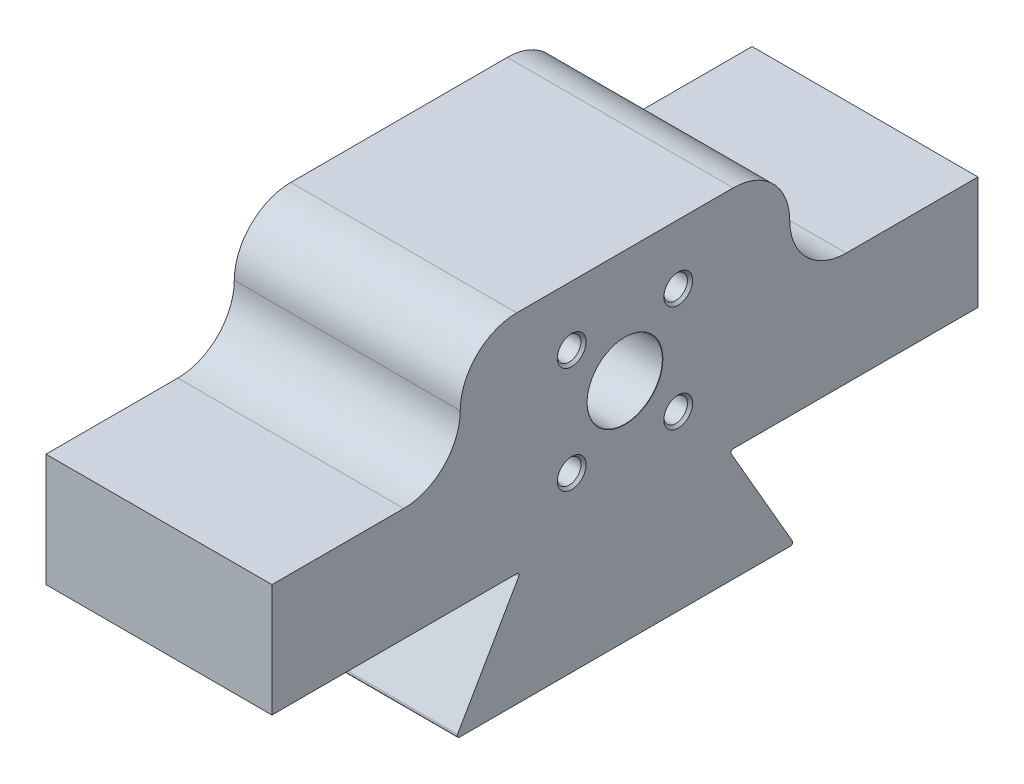
ISO-10303-21;
HEADER;
FILE_DESCRIPTION(('STEP AP214'),'2;1');
FILE_NAME('part.step','',(''),(''),'','','');
FILE_SCHEMA(('AUTOMOTIVE_DESIGN { 1 0 10303 214 1 1 1 1 }'));
ENDSEC;
DATA;
#1=APPLICATION_CONTEXT('core data for automotive mechanical design processes');
#2=APPLICATION_PROTOCOL_DEFINITION('international standard','automotive_design',2000,#1);
#3=PRODUCT_CONTEXT('',#1,'mechanical');
#4=PRODUCT('Part','Part','',(#3));
#5=PRODUCT_RELATED_PRODUCT_CATEGORY('part','',(#4));
#6=PRODUCT_DEFINITION_FORMATION('','',#4);
#7=PRODUCT_DEFINITION_CONTEXT('part definition',#1,'design');
#8=PRODUCT_DEFINITION('design','',#6,#7);
#9=PRODUCT_DEFINITION_SHAPE('','',#8);
#10=(LENGTH_UNIT() NAMED_UNIT(*) SI_UNIT(.MILLI.,.METRE.));
#11=(NAMED_UNIT(*) PLANE_ANGLE_UNIT() SI_UNIT($,.RADIAN.));
#12=(NAMED_UNIT(*) SI_UNIT($,.STERADIAN.) SOLID_ANGLE_UNIT());
#13=UNCERTAINTY_MEASURE_WITH_UNIT(LENGTH_MEASURE(1.E-05),#10,'distance_accuracy_value','');
#14=(GEOMETRIC_REPRESENTATION_CONTEXT(3) GLOBAL_UNCERTAINTY_ASSIGNED_CONTEXT((#13)) GLOBAL_UNIT_ASSIGNED_CONTEXT((#10,
#11,#12)) REPRESENTATION_CONTEXT('',''));
#15=CARTESIAN_POINT('',(0.,0.,0.));
#16=DIRECTION('',(0.,0.,1.));
#17=DIRECTION('',(1.,0.,0.));
#18=AXIS2_PLACEMENT_3D('',#15,#16,#17);
#19=CARTESIAN_POINT('',(24.,-12.0000000000001,-37.4999999999996));
#20=DIRECTION('',(0.,1.,0.));
#21=DIRECTION('',(0.,0.,1.));
#22=AXIS2_PLACEMENT_3D('',#19,#20,#21);
#23=PLANE('',#22);
#24=DIRECTION('',(0.,0.,-1.));
#25=VECTOR('',#24,1.);
#26=CARTESIAN_POINT('',(24.,-12.0000000000001,-37.4999999999996));
#27=LINE('',#26,#25);
#28=CARTESIAN_POINT('',(24.,-12.0000000000001,-11.5048094716166));
#29=VERTEX_POINT('',#28);
#30=CARTESIAN_POINT('',(24.,-12.0000000000001,-37.4999999999996));
#31=VERTEX_POINT('',#30);
#32=EDGE_CURVE('E251',#29,#31,#27,.T.);
#33=ORIENTED_EDGE('',*,*,#32,.F.);
#34=DIRECTION('',(1.,0.,0.));
#35=VECTOR('',#34,1.);
#36=CARTESIAN_POINT('',(24.,-12.0000000000001,-11.5048094716166));
#37=LINE('',#36,#35);
#38=CARTESIAN_POINT('',(0.,-12.0000000000001,-11.5048094716166));
#39=VERTEX_POINT('',#38);
#40=EDGE_CURVE('E323',#29,#39,#37,.F.);
#41=ORIENTED_EDGE('',*,*,#40,.T.);
#42=DIRECTION('',(0.,0.,-1.));
#43=VECTOR('',#42,1.);
#44=CARTESIAN_POINT('',(0.,-12.0000000000001,-37.4999999999996));
#45=LINE('',#44,#43);
#46=CARTESIAN_POINT('',(0.,-12.0000000000001,-37.4999999999996));
#47=VERTEX_POINT('',#46);
#48=EDGE_CURVE('E263',#39,#47,#45,.T.);
#49=ORIENTED_EDGE('',*,*,#48,.T.);
#50=DIRECTION('',(-1.,0.,0.));
#51=VECTOR('',#50,1.);
#52=CARTESIAN_POINT('',(24.,-12.0000000000001,-37.4999999999996));
#53=LINE('',#52,#51);
#54=EDGE_CURVE('E261',#31,#47,#53,.T.);
#55=ORIENTED_EDGE('',*,*,#54,.F.);
#56=EDGE_LOOP('',(#33,#41,#49,#55));
#57=FACE_BOUND('',#56,.T.);
#58=ADVANCED_FACE('F38',(#57),#23,.F.);
#59=CARTESIAN_POINT('',(24.,11.9999999999999,-37.4999999999996));
#60=DIRECTION('',(0.,0.,1.));
#61=DIRECTION('',(1.,0.,0.));
#62=AXIS2_PLACEMENT_3D('',#59,#60,#61);
#63=PLANE('',#62);
#64=DIRECTION('',(1.,0.,0.));
#65=VECTOR('',#64,1.);
#66=CARTESIAN_POINT('',(0.,-1.40512601554121E-13,-37.5000000000001));
#67=LINE('',#66,#65);
#68=CARTESIAN_POINT('',(0.,-1.40512601554121E-13,-37.5000000000001));
#69=VERTEX_POINT('',#68);
#70=CARTESIAN_POINT('',(24.,-1.40512601554121E-13,-37.5000000000001));
#71=VERTEX_POINT('',#70);
#72=EDGE_CURVE('E233',#69,#71,#67,.T.);
#73=ORIENTED_EDGE('',*,*,#72,.T.);
#74=DIRECTION('',(0.,1.,0.));
#75=VECTOR('',#74,1.);
#76=CARTESIAN_POINT('',(24.,11.9999999999999,-37.4999999999996));
#77=LINE('',#76,#75);
#78=EDGE_CURVE('E256',#31,#71,#77,.T.);
#79=ORIENTED_EDGE('',*,*,#78,.F.);
#80=ORIENTED_EDGE('',*,*,#54,.T.);
#81=DIRECTION('',(0.,1.,0.));
#82=VECTOR('',#81,1.);
#83=CARTESIAN_POINT('',(0.,11.9999999999999,-37.4999999999996));
#84=LINE('',#83,#82);
#85=EDGE_CURVE('E266',#47,#69,#84,.T.);
#86=ORIENTED_EDGE('',*,*,#85,.T.);
#87=EDGE_LOOP('',(#73,#79,#80,#86));
#88=FACE_BOUND('',#87,.T.);
#89=ADVANCED_FACE('F396',(#88),#63,.F.);
#90=CARTESIAN_POINT('',(24.,11.9999999999999,-37.4999999999996));
#91=DIRECTION('',(0.,-1.,0.));
#92=DIRECTION('',(0.,0.,-1.));
#93=AXIS2_PLACEMENT_3D('',#90,#91,#92);
#94=PLANE('',#93);
#95=DIRECTION('',(0.,0.,1.));
#96=VECTOR('',#95,1.);
#97=CARTESIAN_POINT('',(24.,11.9999999999999,-37.4999999999996));
#98=LINE('',#97,#96);
#99=CARTESIAN_POINT('',(24.,11.9999999999999,-11.5000000000001));
#100=VERTEX_POINT('',#99);
#101=CARTESIAN_POINT('',(24.,11.9999999999999,11.5000000000001));
#102=VERTEX_POINT('',#101);
#103=EDGE_CURVE('E259',#100,#102,#98,.T.);
#104=ORIENTED_EDGE('',*,*,#103,.F.);
#105=DIRECTION('',(1.,0.,0.));
#106=VECTOR('',#105,1.);
#107=CARTESIAN_POINT('',(0.,11.9999999999999,-11.5000000000001));
#108=LINE('',#107,#106);
#109=CARTESIAN_POINT('',(0.,11.9999999999999,-11.5000000000001));
#110=VERTEX_POINT('',#109);
#111=EDGE_CURVE('E293',#100,#110,#108,.F.);
#112=ORIENTED_EDGE('',*,*,#111,.T.);
#113=DIRECTION('',(0.,0.,1.));
#114=VECTOR('',#113,1.);
#115=CARTESIAN_POINT('',(0.,11.9999999999999,-37.4999999999996));
#116=LINE('',#115,#114);
#117=CARTESIAN_POINT('',(0.,11.9999999999999,11.5000000000001));
#118=VERTEX_POINT('',#117);
#119=EDGE_CURVE('E252',#110,#118,#116,.T.);
#120=ORIENTED_EDGE('',*,*,#119,.T.);
#121=DIRECTION('',(1.,0.,0.));
#122=VECTOR('',#121,1.);
#123=CARTESIAN_POINT('',(24.,11.9999999999999,11.5000000000001));
#124=LINE('',#123,#122);
#125=EDGE_CURVE('E275',#118,#102,#124,.T.);
#126=ORIENTED_EDGE('',*,*,#125,.T.);
#127=EDGE_LOOP('',(#104,#112,#120,#126));
#128=FACE_BOUND('',#127,.T.);
#129=ADVANCED_FACE('F380',(#128),#94,.F.);
#130=CARTESIAN_POINT('',(24.,0.,0.));
#131=DIRECTION('',(-1.,0.,0.));
#132=DIRECTION('',(0.,0.,1.));
#133=AXIS2_PLACEMENT_3D('',#130,#131,#132);
#134=PLANE('',#133);
#135=CARTESIAN_POINT('',(24.,5.65685424949238,5.65685424949238));
#136=DIRECTION('',(1.,0.,0.));
#137=DIRECTION('',(0.,0.,-1.));
#138=AXIS2_PLACEMENT_3D('',#135,#136,#137);
#139=CIRCLE('',#138,1.525);
#140=CARTESIAN_POINT('',(24.,5.65685424949238,4.13185424949238));
#141=VERTEX_POINT('',#140);
#142=EDGE_CURVE('E193',#141,#141,#139,.T.);
#143=ORIENTED_EDGE('',*,*,#142,.F.);
#144=EDGE_LOOP('',(#143));
#145=FACE_BOUND('',#144,.T.);
#146=CARTESIAN_POINT('',(24.,5.65685424949238,-5.65685424949238));
#147=DIRECTION('',(1.,0.,0.));
#148=DIRECTION('',(0.,0.,-1.));
#149=AXIS2_PLACEMENT_3D('',#146,#147,#148);
#150=CIRCLE('',#149,1.525);
#151=CARTESIAN_POINT('',(24.,5.65685424949238,-7.18185424949238));
#152=VERTEX_POINT('',#151);
#153=EDGE_CURVE('E186',#152,#152,#150,.T.);
#154=ORIENTED_EDGE('',*,*,#153,.F.);
#155=EDGE_LOOP('',(#154));
#156=FACE_BOUND('',#155,.T.);
#157=CARTESIAN_POINT('',(24.,-5.65685424949238,-5.65685424949238));
#158=DIRECTION('',(1.,0.,0.));
#159=DIRECTION('',(0.,0.,-1.));
#160=AXIS2_PLACEMENT_3D('',#157,#158,#159);
#161=CIRCLE('',#160,1.525);
#162=CARTESIAN_POINT('',(24.,-5.65685424949238,-7.18185424949238));
#163=VERTEX_POINT('',#162);
#164=EDGE_CURVE('E202',#163,#163,#161,.T.);
#165=ORIENTED_EDGE('',*,*,#164,.F.);
#166=EDGE_LOOP('',(#165));
#167=FACE_BOUND('',#166,.T.);
#168=CARTESIAN_POINT('',(24.,-5.65685424949238,5.65685424949238));
#169=DIRECTION('',(1.,0.,0.));
#170=DIRECTION('',(0.,0.,-1.));
#171=AXIS2_PLACEMENT_3D('',#168,#169,#170);
#172=CIRCLE('',#171,1.525);
#173=CARTESIAN_POINT('',(24.,-5.65685424949238,4.13185424949238));
#174=VERTEX_POINT('',#173);
#175=EDGE_CURVE('E211',#174,#174,#172,.T.);
#176=ORIENTED_EDGE('',*,*,#175,.F.);
#177=EDGE_LOOP('',(#176));
#178=FACE_BOUND('',#177,.T.);
#179=CARTESIAN_POINT('',(24.,0.,0.));
#180=DIRECTION('',(1.,0.,0.));
#181=DIRECTION('',(0.,0.,-1.));
#182=AXIS2_PLACEMENT_3D('',#179,#180,#181);
#183=CIRCLE('',#182,4.025);
#184=CARTESIAN_POINT('',(24.,0.,-4.025));
#185=VERTEX_POINT('',#184);
#186=EDGE_CURVE('E220',#185,#185,#183,.T.);
#187=ORIENTED_EDGE('',*,*,#186,.F.);
#188=EDGE_LOOP('',(#187));
#189=FACE_BOUND('',#188,.T.);
#190=DIRECTION('',(0.,0.,-1.));
#191=VECTOR('',#190,1.);
#192=CARTESIAN_POINT('',(24.,-24.0000000000001,18.));
#193=LINE('',#192,#191);
#194=CARTESIAN_POINT('',(24.,-24.0000000000001,17.5669872981078));
#195=VERTEX_POINT('',#194);
#196=CARTESIAN_POINT('',(24.,-24.0000000000001,-17.5669872981078));
#197=VERTEX_POINT('',#196);
#198=EDGE_CURVE('E349',#195,#197,#193,.T.);
#199=ORIENTED_EDGE('',*,*,#198,.T.);
#200=CARTESIAN_POINT('',(24.,-23.7500000000001,-17.5669872981078));
#201=DIRECTION('',(-1.,0.,0.));
#202=DIRECTION('',(0.,0.,1.));
#203=AXIS2_PLACEMENT_3D('',#200,#201,#202);
#204=CIRCLE('',#203,0.25);
#205=CARTESIAN_POINT('',(24.,-23.6250000000001,-17.7834936490539));
#206=VERTEX_POINT('',#205);
#207=EDGE_CURVE('E313',#197,#206,#204,.F.);
#208=ORIENTED_EDGE('',*,*,#207,.T.);
#209=DIRECTION('',(0.,0.866025403784436,0.500000000000004));
#210=VECTOR('',#209,1.);
#211=CARTESIAN_POINT('',(24.,-24.0000000000001,-18.));
#212=LINE('',#211,#210);
#213=CARTESIAN_POINT('',(24.,-12.3750000000001,-11.2883031206705));
#214=VERTEX_POINT('',#213);
#215=EDGE_CURVE('E350',#206,#214,#212,.T.);
#216=ORIENTED_EDGE('',*,*,#215,.T.);
#217=CARTESIAN_POINT('',(24.,-12.2500000000001,-11.5048094716166));
#218=DIRECTION('',(-1.,0.,0.));
#219=DIRECTION('',(0.,0.,1.));
#220=AXIS2_PLACEMENT_3D('',#217,#218,#219);
#221=CIRCLE('',#220,0.25);
#222=EDGE_CURVE('E333',#214,#29,#221,.T.);
#223=ORIENTED_EDGE('',*,*,#222,.T.);
#224=ORIENTED_EDGE('',*,*,#32,.T.);
#225=ORIENTED_EDGE('',*,*,#78,.T.);
#226=DIRECTION('',(0.,0.,1.));
#227=VECTOR('',#226,1.);
#228=CARTESIAN_POINT('',(24.,-1.40512601554121E-13,-37.5000000000001));
#229=LINE('',#228,#227);
#230=CARTESIAN_POINT('',(24.,0.,-23.5));
#231=VERTEX_POINT('',#230);
#232=EDGE_CURVE('E234',#71,#231,#229,.T.);
#233=ORIENTED_EDGE('',*,*,#232,.T.);
#234=CARTESIAN_POINT('',(24.,5.99999999999996,-23.5000000000001));
#235=DIRECTION('',(-1.,0.,0.));
#236=DIRECTION('',(0.,0.,1.));
#237=AXIS2_PLACEMENT_3D('',#234,#235,#236);
#238=CIRCLE('',#237,6.);
#239=CARTESIAN_POINT('',(24.,5.99999999999987,-17.5000000000001));
#240=VERTEX_POINT('',#239);
#241=EDGE_CURVE('E300',#231,#240,#238,.T.);
#242=ORIENTED_EDGE('',*,*,#241,.T.);
#243=CARTESIAN_POINT('',(24.,5.99999999999987,-11.5000000000001));
#244=DIRECTION('',(-1.,0.,0.));
#245=DIRECTION('',(0.,0.,1.));
#246=AXIS2_PLACEMENT_3D('',#243,#244,#245);
#247=CIRCLE('',#246,6.);
#248=EDGE_CURVE('E289',#240,#100,#247,.F.);
#249=ORIENTED_EDGE('',*,*,#248,.T.);
#250=ORIENTED_EDGE('',*,*,#103,.T.);
#251=CARTESIAN_POINT('',(24.,5.99999999999986,11.5000000000001));
#252=DIRECTION('',(-1.,0.,0.));
#253=DIRECTION('',(0.,0.,1.));
#254=AXIS2_PLACEMENT_3D('',#251,#252,#253);
#255=CIRCLE('',#254,6.);
#256=CARTESIAN_POINT('',(24.,5.99999999999986,17.5000000000001));
#257=VERTEX_POINT('',#256);
#258=EDGE_CURVE('E278',#102,#257,#255,.F.);
#259=ORIENTED_EDGE('',*,*,#258,.T.);
#260=CARTESIAN_POINT('',(24.,5.99999999999996,23.5000000000001));
#261=DIRECTION('',(-1.,0.,0.));
#262=DIRECTION('',(0.,0.,1.));
#263=AXIS2_PLACEMENT_3D('',#260,#261,#262);
#264=CIRCLE('',#263,6.);
#265=CARTESIAN_POINT('',(24.,0.,23.5));
#266=VERTEX_POINT('',#265);
#267=EDGE_CURVE('E285',#257,#266,#264,.T.);
#268=ORIENTED_EDGE('',*,*,#267,.T.);
#269=DIRECTION('',(0.,0.,-1.));
#270=VECTOR('',#269,1.);
#271=CARTESIAN_POINT('',(24.,-1.40512601554121E-13,37.5000000000001));
#272=LINE('',#271,#270);
#273=CARTESIAN_POINT('',(24.,-1.40512601554121E-13,37.5000000000001));
#274=VERTEX_POINT('',#273);
#275=EDGE_CURVE('E244',#274,#266,#272,.T.);
#276=ORIENTED_EDGE('',*,*,#275,.F.);
#277=DIRECTION('',(0.,-1.,0.));
#278=VECTOR('',#277,1.);
#279=CARTESIAN_POINT('',(24.,11.9999999999999,37.5000000000001));
#280=LINE('',#279,#278);
#281=CARTESIAN_POINT('',(24.,-12.0000000000001,37.5000000000001));
#282=VERTEX_POINT('',#281);
#283=EDGE_CURVE('E249',#274,#282,#280,.T.);
#284=ORIENTED_EDGE('',*,*,#283,.T.);
#285=CARTESIAN_POINT('',(24.,-12.0000000000001,11.5048094716166));
#286=VERTEX_POINT('',#285);
#287=EDGE_CURVE('E253',#282,#286,#27,.T.);
#288=ORIENTED_EDGE('',*,*,#287,.T.);
#289=CARTESIAN_POINT('',(24.,-12.2500000000001,11.5048094716166));
#290=DIRECTION('',(-1.,0.,0.));
#291=DIRECTION('',(0.,0.,1.));
#292=AXIS2_PLACEMENT_3D('',#289,#290,#291);
#293=CIRCLE('',#292,0.25);
#294=CARTESIAN_POINT('',(24.,-12.3750000000001,11.2883031206705));
#295=VERTEX_POINT('',#294);
#296=EDGE_CURVE('E46',#286,#295,#293,.T.);
#297=ORIENTED_EDGE('',*,*,#296,.T.);
#298=DIRECTION('',(0.,-0.866025403784436,0.500000000000004));
#299=VECTOR('',#298,1.);
#300=CARTESIAN_POINT('',(24.,-12.0000000000001,11.0717967697244));
#301=LINE('',#300,#299);
#302=CARTESIAN_POINT('',(24.,-23.6250000000001,17.7834936490539));
#303=VERTEX_POINT('',#302);
#304=EDGE_CURVE('E341',#295,#303,#301,.T.);
#305=ORIENTED_EDGE('',*,*,#304,.T.);
#306=CARTESIAN_POINT('',(24.,-23.7500000000001,17.5669872981078));
#307=DIRECTION('',(-1.,0.,0.));
#308=DIRECTION('',(0.,0.,1.));
#309=AXIS2_PLACEMENT_3D('',#306,#307,#308);
#310=CIRCLE('',#309,0.25);
#311=EDGE_CURVE('E311',#303,#195,#310,.F.);
#312=ORIENTED_EDGE('',*,*,#311,.T.);
#313=EDGE_LOOP('',(#199,#208,#216,#223,#224,#225,#233,#242,#249,#250,#259,#268,#276,#284,#288,
#297,#305,#312));
#314=FACE_BOUND('',#313,.T.);
#315=ADVANCED_FACE('F340',(#145,#156,#167,#178,#189,#314),#134,.F.);
#316=CARTESIAN_POINT('',(0.,0.,0.));
#317=DIRECTION('',(-1.,0.,0.));
#318=DIRECTION('',(0.,0.,1.));
#319=AXIS2_PLACEMENT_3D('',#316,#317,#318);
#320=PLANE('',#319);
#321=DIRECTION('',(0.,0.866025403784436,0.500000000000004));
#322=VECTOR('',#321,1.);
#323=CARTESIAN_POINT('',(0.,-24.0000000000001,-18.));
#324=LINE('',#323,#322);
#325=CARTESIAN_POINT('',(0.,-23.6250000000001,-17.7834936490539));
#326=VERTEX_POINT('',#325);
#327=CARTESIAN_POINT('',(0.,-12.3750000000001,-11.2883031206705));
#328=VERTEX_POINT('',#327);
#329=EDGE_CURVE('E412',#326,#328,#324,.T.);
#330=ORIENTED_EDGE('',*,*,#329,.F.);
#331=CARTESIAN_POINT('',(0.,-23.7500000000001,-17.5669872981078));
#332=DIRECTION('',(-1.,0.,0.));
#333=DIRECTION('',(0.,0.,1.));
#334=AXIS2_PLACEMENT_3D('',#331,#332,#333);
#335=CIRCLE('',#334,0.25);
#336=CARTESIAN_POINT('',(0.,-24.0000000000001,-17.5669872981078));
#337=VERTEX_POINT('',#336);
#338=EDGE_CURVE('E321',#326,#337,#335,.T.);
#339=ORIENTED_EDGE('',*,*,#338,.T.);
#340=DIRECTION('',(0.,0.,-1.));
#341=VECTOR('',#340,1.);
#342=CARTESIAN_POINT('',(0.,-24.0000000000001,18.));
#343=LINE('',#342,#341);
#344=CARTESIAN_POINT('',(0.,-24.0000000000001,17.5669872981078));
#345=VERTEX_POINT('',#344);
#346=EDGE_CURVE('E417',#345,#337,#343,.T.);
#347=ORIENTED_EDGE('',*,*,#346,.F.);
#348=CARTESIAN_POINT('',(0.,-23.7500000000001,17.5669872981078));
#349=DIRECTION('',(-1.,0.,0.));
#350=DIRECTION('',(0.,0.,1.));
#351=AXIS2_PLACEMENT_3D('',#348,#349,#350);
#352=CIRCLE('',#351,0.25);
#353=CARTESIAN_POINT('',(0.,-23.6250000000001,17.7834936490539));
#354=VERTEX_POINT('',#353);
#355=EDGE_CURVE('E57',#345,#354,#352,.T.);
#356=ORIENTED_EDGE('',*,*,#355,.T.);
#357=DIRECTION('',(0.,-0.866025403784436,0.500000000000004));
#358=VECTOR('',#357,1.);
#359=CARTESIAN_POINT('',(0.,-12.0000000000001,11.0717967697244));
#360=LINE('',#359,#358);
#361=CARTESIAN_POINT('',(0.,-12.3750000000001,11.2883031206705));
#362=VERTEX_POINT('',#361);
#363=EDGE_CURVE('E420',#362,#354,#360,.T.);
#364=ORIENTED_EDGE('',*,*,#363,.F.);
#365=CARTESIAN_POINT('',(0.,-12.2500000000001,11.5048094716166));
#366=DIRECTION('',(-1.,0.,0.));
#367=DIRECTION('',(0.,0.,1.));
#368=AXIS2_PLACEMENT_3D('',#365,#366,#367);
#369=CIRCLE('',#368,0.25);
#370=CARTESIAN_POINT('',(0.,-12.0000000000001,11.5048094716166));
#371=VERTEX_POINT('',#370);
#372=EDGE_CURVE('E11',#362,#371,#369,.F.);
#373=ORIENTED_EDGE('',*,*,#372,.T.);
#374=CARTESIAN_POINT('',(0.,-12.0000000000001,37.5000000000001));
#375=VERTEX_POINT('',#374);
#376=EDGE_CURVE('E264',#375,#371,#45,.T.);
#377=ORIENTED_EDGE('',*,*,#376,.F.);
#378=DIRECTION('',(0.,-1.,0.));
#379=VECTOR('',#378,1.);
#380=CARTESIAN_POINT('',(0.,11.9999999999999,37.5000000000001));
#381=LINE('',#380,#379);
#382=CARTESIAN_POINT('',(0.,-1.40512601554121E-13,37.5000000000001));
#383=VERTEX_POINT('',#382);
#384=EDGE_CURVE('E248',#383,#375,#381,.T.);
#385=ORIENTED_EDGE('',*,*,#384,.F.);
#386=DIRECTION('',(0.,0.,-1.));
#387=VECTOR('',#386,1.);
#388=CARTESIAN_POINT('',(0.,-1.40512601554121E-13,37.5000000000001));
#389=LINE('',#388,#387);
#390=CARTESIAN_POINT('',(0.,0.,23.5));
#391=VERTEX_POINT('',#390);
#392=EDGE_CURVE('E240',#383,#391,#389,.T.);
#393=ORIENTED_EDGE('',*,*,#392,.T.);
#394=CARTESIAN_POINT('',(0.,5.99999999999996,23.5000000000001));
#395=DIRECTION('',(-1.,0.,0.));
#396=DIRECTION('',(0.,0.,1.));
#397=AXIS2_PLACEMENT_3D('',#394,#395,#396);
#398=CIRCLE('',#397,6.);
#399=CARTESIAN_POINT('',(0.,5.99999999999986,17.5000000000001));
#400=VERTEX_POINT('',#399);
#401=EDGE_CURVE('E287',#391,#400,#398,.F.);
#402=ORIENTED_EDGE('',*,*,#401,.T.);
#403=CARTESIAN_POINT('',(0.,5.99999999999986,11.5000000000001));
#404=DIRECTION('',(-1.,0.,0.));
#405=DIRECTION('',(0.,0.,1.));
#406=AXIS2_PLACEMENT_3D('',#403,#404,#405);
#407=CIRCLE('',#406,6.);
#408=EDGE_CURVE('E280',#400,#118,#407,.T.);
#409=ORIENTED_EDGE('',*,*,#408,.T.);
#410=ORIENTED_EDGE('',*,*,#119,.F.);
#411=CARTESIAN_POINT('',(0.,5.99999999999987,-11.5000000000001));
#412=DIRECTION('',(-1.,0.,0.));
#413=DIRECTION('',(0.,0.,1.));
#414=AXIS2_PLACEMENT_3D('',#411,#412,#413);
#415=CIRCLE('',#414,6.);
#416=CARTESIAN_POINT('',(0.,5.99999999999987,-17.5000000000001));
#417=VERTEX_POINT('',#416);
#418=EDGE_CURVE('E296',#110,#417,#415,.T.);
#419=ORIENTED_EDGE('',*,*,#418,.T.);
#420=CARTESIAN_POINT('',(0.,5.99999999999996,-23.5000000000001));
#421=DIRECTION('',(-1.,0.,0.));
#422=DIRECTION('',(0.,0.,1.));
#423=AXIS2_PLACEMENT_3D('',#420,#421,#422);
#424=CIRCLE('',#423,6.);
#425=CARTESIAN_POINT('',(0.,0.,-23.5));
#426=VERTEX_POINT('',#425);
#427=EDGE_CURVE('E302',#417,#426,#424,.F.);
#428=ORIENTED_EDGE('',*,*,#427,.T.);
#429=DIRECTION('',(0.,0.,1.));
#430=VECTOR('',#429,1.);
#431=CARTESIAN_POINT('',(0.,-1.40512601554121E-13,-37.5000000000001));
#432=LINE('',#431,#430);
#433=EDGE_CURVE('E230',#69,#426,#432,.T.);
#434=ORIENTED_EDGE('',*,*,#433,.F.);
#435=ORIENTED_EDGE('',*,*,#85,.F.);
#436=ORIENTED_EDGE('',*,*,#48,.F.);
#437=CARTESIAN_POINT('',(0.,-12.2500000000001,-11.5048094716166));
#438=DIRECTION('',(-1.,0.,0.));
#439=DIRECTION('',(0.,0.,1.));
#440=AXIS2_PLACEMENT_3D('',#437,#438,#439);
#441=CIRCLE('',#440,0.25);
#442=EDGE_CURVE('E335',#39,#328,#441,.F.);
#443=ORIENTED_EDGE('',*,*,#442,.T.);
#444=EDGE_LOOP('',(#330,#339,#347,#356,#364,#373,#377,#385,#393,#402,#409,#410,#419,#428,#434,
#435,#436,#443));
#445=FACE_BOUND('',#444,.T.);
#446=ADVANCED_FACE('F357',(#445),#320,.T.);
#447=CARTESIAN_POINT('',(24.,11.9999999999999,37.5000000000001));
#448=DIRECTION('',(0.,0.,-1.));
#449=DIRECTION('',(-1.,0.,0.));
#450=AXIS2_PLACEMENT_3D('',#447,#448,#449);
#451=PLANE('',#450);
#452=ORIENTED_EDGE('',*,*,#283,.F.);
#453=DIRECTION('',(1.,0.,0.));
#454=VECTOR('',#453,1.);
#455=CARTESIAN_POINT('',(0.,-1.40512601554121E-13,37.5000000000001));
#456=LINE('',#455,#454);
#457=EDGE_CURVE('E243',#383,#274,#456,.T.);
#458=ORIENTED_EDGE('',*,*,#457,.F.);
#459=ORIENTED_EDGE('',*,*,#384,.T.);
#460=DIRECTION('',(-1.,0.,0.));
#461=VECTOR('',#460,1.);
#462=CARTESIAN_POINT('',(24.,-12.0000000000001,37.5000000000001));
#463=LINE('',#462,#461);
#464=EDGE_CURVE('E272',#282,#375,#463,.T.);
#465=ORIENTED_EDGE('',*,*,#464,.F.);
#466=EDGE_LOOP('',(#452,#458,#459,#465));
#467=FACE_BOUND('',#466,.T.);
#468=ADVANCED_FACE('F362',(#467),#451,.F.);
#469=ORIENTED_EDGE('',*,*,#376,.T.);
#470=DIRECTION('',(1.,0.,0.));
#471=VECTOR('',#470,1.);
#472=CARTESIAN_POINT('',(24.,-12.0000000000001,11.5048094716166));
#473=LINE('',#472,#471);
#474=EDGE_CURVE('E330',#371,#286,#473,.T.);
#475=ORIENTED_EDGE('',*,*,#474,.T.);
#476=ORIENTED_EDGE('',*,*,#287,.F.);
#477=ORIENTED_EDGE('',*,*,#464,.T.);
#478=EDGE_LOOP('',(#469,#475,#476,#477));
#479=FACE_BOUND('',#478,.T.);
#480=ADVANCED_FACE('F353',(#479),#23,.F.);
#481=CARTESIAN_POINT('',(0.,-1.40512601554121E-13,37.5000000000001));
#482=DIRECTION('',(0.,-1.,0.));
#483=DIRECTION('',(0.,0.,-1.));
#484=AXIS2_PLACEMENT_3D('',#481,#482,#483);
#485=PLANE('',#484);
#486=ORIENTED_EDGE('',*,*,#275,.T.);
#487=DIRECTION('',(1.,0.,0.));
#488=VECTOR('',#487,1.);
#489=CARTESIAN_POINT('',(0.,0.,23.5));
#490=LINE('',#489,#488);
#491=EDGE_CURVE('E283',#266,#391,#490,.F.);
#492=ORIENTED_EDGE('',*,*,#491,.T.);
#493=ORIENTED_EDGE('',*,*,#392,.F.);
#494=ORIENTED_EDGE('',*,*,#457,.T.);
#495=EDGE_LOOP('',(#486,#492,#493,#494));
#496=FACE_BOUND('',#495,.T.);
#497=ADVANCED_FACE('F365',(#496),#485,.F.);
#498=CARTESIAN_POINT('',(0.,5.99999999999996,23.5000000000001));
#499=DIRECTION('',(-1.,0.,0.));
#500=DIRECTION('',(0.,0.,1.));
#501=AXIS2_PLACEMENT_3D('',#498,#499,#500);
#502=CYLINDRICAL_SURFACE('',#501,6.);
#503=DIRECTION('',(1.,0.,0.));
#504=VECTOR('',#503,1.);
#505=CARTESIAN_POINT('',(24.,5.99999999999996,17.5000000000001));
#506=LINE('',#505,#504);
#507=EDGE_CURVE('E239',#400,#257,#506,.T.);
#508=ORIENTED_EDGE('',*,*,#507,.F.);
#509=ORIENTED_EDGE('',*,*,#401,.F.);
#510=ORIENTED_EDGE('',*,*,#491,.F.);
#511=ORIENTED_EDGE('',*,*,#267,.F.);
#512=EDGE_LOOP('',(#508,#509,#510,#511));
#513=FACE_BOUND('',#512,.T.);
#514=ADVANCED_FACE('F371',(#513),#502,.F.);
#515=CARTESIAN_POINT('',(24.,5.99999999999986,11.5000000000001));
#516=DIRECTION('',(1.,0.,0.));
#517=DIRECTION('',(0.,0.,-1.));
#518=AXIS2_PLACEMENT_3D('',#515,#516,#517);
#519=CYLINDRICAL_SURFACE('',#518,6.);
#520=ORIENTED_EDGE('',*,*,#408,.F.);
#521=ORIENTED_EDGE('',*,*,#507,.T.);
#522=ORIENTED_EDGE('',*,*,#258,.F.);
#523=ORIENTED_EDGE('',*,*,#125,.F.);
#524=EDGE_LOOP('',(#520,#521,#522,#523));
#525=FACE_BOUND('',#524,.T.);
#526=ADVANCED_FACE('F374',(#525),#519,.T.);
#527=CARTESIAN_POINT('',(0.,-1.40512601554121E-13,-37.5000000000001));
#528=DIRECTION('',(0.,1.,0.));
#529=DIRECTION('',(0.,0.,1.));
#530=AXIS2_PLACEMENT_3D('',#527,#528,#529);
#531=PLANE('',#530);
#532=ORIENTED_EDGE('',*,*,#433,.T.);
#533=DIRECTION('',(1.,0.,0.));
#534=VECTOR('',#533,1.);
#535=CARTESIAN_POINT('',(24.,0.,-23.5));
#536=LINE('',#535,#534);
#537=EDGE_CURVE('E298',#426,#231,#536,.T.);
#538=ORIENTED_EDGE('',*,*,#537,.T.);
#539=ORIENTED_EDGE('',*,*,#232,.F.);
#540=ORIENTED_EDGE('',*,*,#72,.F.);
#541=EDGE_LOOP('',(#532,#538,#539,#540));
#542=FACE_BOUND('',#541,.T.);
#543=ADVANCED_FACE('F393',(#542),#531,.T.);
#544=CARTESIAN_POINT('',(0.,5.99999999999996,-23.5000000000001));
#545=DIRECTION('',(-1.,0.,0.));
#546=DIRECTION('',(0.,0.,1.));
#547=AXIS2_PLACEMENT_3D('',#544,#545,#546);
#548=CYLINDRICAL_SURFACE('',#547,6.);
#549=ORIENTED_EDGE('',*,*,#537,.F.);
#550=ORIENTED_EDGE('',*,*,#427,.F.);
#551=DIRECTION('',(1.,0.,0.));
#552=VECTOR('',#551,1.);
#553=CARTESIAN_POINT('',(0.,5.99999999999996,-17.5000000000001));
#554=LINE('',#553,#552);
#555=EDGE_CURVE('E229',#240,#417,#554,.F.);
#556=ORIENTED_EDGE('',*,*,#555,.F.);
#557=ORIENTED_EDGE('',*,*,#241,.F.);
#558=EDGE_LOOP('',(#549,#550,#556,#557));
#559=FACE_BOUND('',#558,.T.);
#560=ADVANCED_FACE('F389',(#559),#548,.F.);
#561=CARTESIAN_POINT('',(0.,5.99999999999987,-11.5000000000001));
#562=DIRECTION('',(-1.,0.,0.));
#563=DIRECTION('',(0.,0.,1.));
#564=AXIS2_PLACEMENT_3D('',#561,#562,#563);
#565=CYLINDRICAL_SURFACE('',#564,6.);
#566=ORIENTED_EDGE('',*,*,#418,.F.);
#567=ORIENTED_EDGE('',*,*,#111,.F.);
#568=ORIENTED_EDGE('',*,*,#248,.F.);
#569=ORIENTED_EDGE('',*,*,#555,.T.);
#570=EDGE_LOOP('',(#566,#567,#568,#569));
#571=FACE_BOUND('',#570,.T.);
#572=ADVANCED_FACE('F384',(#571),#565,.T.);
#573=CARTESIAN_POINT('',(9.,0.,0.));
#574=DIRECTION('',(1.,0.,0.));
#575=DIRECTION('',(0.,0.,-1.));
#576=AXIS2_PLACEMENT_3D('',#573,#574,#575);
#577=CONICAL_SURFACE('',#576,3.99999999999999,1.02974425867665);
#578=CARTESIAN_POINT('',(6.59655752388976,0.,0.));
#579=VERTEX_POINT('',#578);
#580=VERTEX_LOOP('',#579);
#581=FACE_BOUND('',#580,.T.);
#582=CARTESIAN_POINT('',(9.,0.,0.));
#583=DIRECTION('',(1.,0.,0.));
#584=DIRECTION('',(0.,0.,-1.));
#585=AXIS2_PLACEMENT_3D('',#582,#583,#584);
#586=CIRCLE('',#585,3.99999999999999);
#587=CARTESIAN_POINT('',(9.,0.,-3.99999999999999));
#588=VERTEX_POINT('',#587);
#589=EDGE_CURVE('E226',#588,#588,#586,.T.);
#590=ORIENTED_EDGE('',*,*,#589,.T.);
#591=EDGE_LOOP('',(#590));
#592=FACE_BOUND('',#591,.T.);
#593=ADVANCED_FACE('F450',(#581,#592),#577,.F.);
#594=CARTESIAN_POINT('',(24.,0.,0.));
#595=DIRECTION('',(1.,0.,0.));
#596=DIRECTION('',(0.,0.,-1.));
#597=AXIS2_PLACEMENT_3D('',#594,#595,#596);
#598=CYLINDRICAL_SURFACE('',#597,3.99999999999999);
#599=ORIENTED_EDGE('',*,*,#589,.F.);
#600=EDGE_LOOP('',(#599));
#601=FACE_BOUND('',#600,.T.);
#602=CARTESIAN_POINT('',(23.975,0.,0.));
#603=DIRECTION('',(1.,0.,0.));
#604=DIRECTION('',(0.,0.,-1.));
#605=AXIS2_PLACEMENT_3D('',#602,#603,#604);
#606=CIRCLE('',#605,4.);
#607=CARTESIAN_POINT('',(23.975,0.,-4.));
#608=VERTEX_POINT('',#607);
#609=EDGE_CURVE('E223',#608,#608,#606,.T.);
#610=ORIENTED_EDGE('',*,*,#609,.T.);
#611=EDGE_LOOP('',(#610));
#612=FACE_BOUND('',#611,.T.);
#613=ADVANCED_FACE('F440',(#601,#612),#598,.F.);
#614=CARTESIAN_POINT('',(24.,0.,0.));
#615=DIRECTION('',(1.,0.,0.));
#616=DIRECTION('',(0.,0.,-1.));
#617=AXIS2_PLACEMENT_3D('',#614,#615,#616);
#618=CONICAL_SURFACE('',#617,4.025,0.785398163397344);
#619=ORIENTED_EDGE('',*,*,#609,.F.);
#620=EDGE_LOOP('',(#619));
#621=FACE_BOUND('',#620,.T.);
#622=ORIENTED_EDGE('',*,*,#186,.T.);
#623=EDGE_LOOP('',(#622));
#624=FACE_BOUND('',#623,.T.);
#625=ADVANCED_FACE('F437',(#621,#624),#618,.F.);
#626=CARTESIAN_POINT('',(16.5,-5.65685424949238,5.65685424949238));
#627=DIRECTION('',(1.,0.,0.));
#628=DIRECTION('',(0.,0.,-1.));
#629=AXIS2_PLACEMENT_3D('',#626,#627,#628);
#630=CONICAL_SURFACE('',#629,1.25,1.02974425867665);
#631=CARTESIAN_POINT('',(15.7489242262155,-5.65685424949238,5.65685424949238));
#632=VERTEX_POINT('',#631);
#633=VERTEX_LOOP('',#632);
#634=FACE_BOUND('',#633,.T.);
#635=CARTESIAN_POINT('',(16.5,-5.65685424949238,5.65685424949238));
#636=DIRECTION('',(1.,0.,0.));
#637=DIRECTION('',(0.,0.,-1.));
#638=AXIS2_PLACEMENT_3D('',#635,#636,#637);
#639=CIRCLE('',#638,1.25);
#640=CARTESIAN_POINT('',(16.5,-5.65685424949238,4.40685424949238));
#641=VERTEX_POINT('',#640);
#642=EDGE_CURVE('E217',#641,#641,#639,.T.);
#643=ORIENTED_EDGE('',*,*,#642,.T.);
#644=EDGE_LOOP('',(#643));
#645=FACE_BOUND('',#644,.T.);
#646=ADVANCED_FACE('F439',(#634,#645),#630,.F.);
#647=CARTESIAN_POINT('',(24.,-5.65685424949238,5.65685424949238));
#648=DIRECTION('',(1.,0.,0.));
#649=DIRECTION('',(0.,0.,-1.));
#650=AXIS2_PLACEMENT_3D('',#647,#648,#649);
#651=CYLINDRICAL_SURFACE('',#650,1.25);
#652=ORIENTED_EDGE('',*,*,#642,.F.);
#653=EDGE_LOOP('',(#652));
#654=FACE_BOUND('',#653,.T.);
#655=CARTESIAN_POINT('',(23.725,-5.65685424949238,5.65685424949238));
#656=DIRECTION('',(1.,0.,0.));
#657=DIRECTION('',(0.,0.,-1.));
#658=AXIS2_PLACEMENT_3D('',#655,#656,#657);
#659=CIRCLE('',#658,1.25);
#660=CARTESIAN_POINT('',(23.725,-5.65685424949238,4.40685424949238));
#661=VERTEX_POINT('',#660);
#662=EDGE_CURVE('E214',#661,#661,#659,.T.);
#663=ORIENTED_EDGE('',*,*,#662,.T.);
#664=EDGE_LOOP('',(#663));
#665=FACE_BOUND('',#664,.T.);
#666=ADVANCED_FACE('F447',(#654,#665),#651,.F.);
#667=CARTESIAN_POINT('',(24.,-5.65685424949238,5.65685424949238));
#668=DIRECTION('',(1.,0.,0.));
#669=DIRECTION('',(0.,0.,-1.));
#670=AXIS2_PLACEMENT_3D('',#667,#668,#669);
#671=CONICAL_SURFACE('',#670,1.525,0.78539816339744);
#672=ORIENTED_EDGE('',*,*,#662,.F.);
#673=EDGE_LOOP('',(#672));
#674=FACE_BOUND('',#673,.T.);
#675=ORIENTED_EDGE('',*,*,#175,.T.);
#676=EDGE_LOOP('',(#675));
#677=FACE_BOUND('',#676,.T.);
#678=ADVANCED_FACE('F533',(#674,#677),#671,.F.);
#679=CARTESIAN_POINT('',(16.5,-5.65685424949238,-5.65685424949238));
#680=DIRECTION('',(1.,0.,0.));
#681=DIRECTION('',(0.,0.,-1.));
#682=AXIS2_PLACEMENT_3D('',#679,#680,#681);
#683=CONICAL_SURFACE('',#682,1.25,1.02974425867665);
#684=CARTESIAN_POINT('',(15.7489242262155,-5.65685424949238,-5.65685424949238));
#685=VERTEX_POINT('',#684);
#686=VERTEX_LOOP('',#685);
#687=FACE_BOUND('',#686,.T.);
#688=CARTESIAN_POINT('',(16.5,-5.65685424949238,-5.65685424949238));
#689=DIRECTION('',(1.,0.,0.));
#690=DIRECTION('',(0.,0.,-1.));
#691=AXIS2_PLACEMENT_3D('',#688,#689,#690);
#692=CIRCLE('',#691,1.25);
#693=CARTESIAN_POINT('',(16.5,-5.65685424949238,-6.90685424949238));
#694=VERTEX_POINT('',#693);
#695=EDGE_CURVE('E208',#694,#694,#692,.T.);
#696=ORIENTED_EDGE('',*,*,#695,.T.);
#697=EDGE_LOOP('',(#696));
#698=FACE_BOUND('',#697,.T.);
#699=ADVANCED_FACE('F529',(#687,#698),#683,.F.);
#700=CARTESIAN_POINT('',(24.,-5.65685424949238,-5.65685424949238));
#701=DIRECTION('',(1.,0.,0.));
#702=DIRECTION('',(0.,0.,-1.));
#703=AXIS2_PLACEMENT_3D('',#700,#701,#702);
#704=CYLINDRICAL_SURFACE('',#703,1.25);
#705=ORIENTED_EDGE('',*,*,#695,.F.);
#706=EDGE_LOOP('',(#705));
#707=FACE_BOUND('',#706,.T.);
#708=CARTESIAN_POINT('',(23.725,-5.65685424949238,-5.65685424949238));
#709=DIRECTION('',(1.,0.,0.));
#710=DIRECTION('',(0.,0.,-1.));
#711=AXIS2_PLACEMENT_3D('',#708,#709,#710);
#712=CIRCLE('',#711,1.25);
#713=CARTESIAN_POINT('',(23.725,-5.65685424949238,-6.90685424949238));
#714=VERTEX_POINT('',#713);
#715=EDGE_CURVE('E205',#714,#714,#712,.T.);
#716=ORIENTED_EDGE('',*,*,#715,.T.);
#717=EDGE_LOOP('',(#716));
#718=FACE_BOUND('',#717,.T.);
#719=ADVANCED_FACE('F525',(#707,#718),#704,.F.);
#720=CARTESIAN_POINT('',(24.,-5.65685424949238,-5.65685424949238));
#721=DIRECTION('',(1.,0.,0.));
#722=DIRECTION('',(0.,0.,-1.));
#723=AXIS2_PLACEMENT_3D('',#720,#721,#722);
#724=CONICAL_SURFACE('',#723,1.525,0.78539816339744);
#725=ORIENTED_EDGE('',*,*,#715,.F.);
#726=EDGE_LOOP('',(#725));
#727=FACE_BOUND('',#726,.T.);
#728=ORIENTED_EDGE('',*,*,#164,.T.);
#729=EDGE_LOOP('',(#728));
#730=FACE_BOUND('',#729,.T.);
#731=ADVANCED_FACE('F521',(#727,#730),#724,.F.);
#732=CARTESIAN_POINT('',(16.5,5.65685424949238,-5.65685424949238));
#733=DIRECTION('',(1.,0.,0.));
#734=DIRECTION('',(0.,0.,-1.));
#735=AXIS2_PLACEMENT_3D('',#732,#733,#734);
#736=CONICAL_SURFACE('',#735,1.25,1.02974425867665);
#737=CARTESIAN_POINT('',(15.7489242262155,5.65685424949238,-5.65685424949238));
#738=VERTEX_POINT('',#737);
#739=VERTEX_LOOP('',#738);
#740=FACE_BOUND('',#739,.T.);
#741=CARTESIAN_POINT('',(16.5,5.65685424949238,-5.65685424949238));
#742=DIRECTION('',(1.,0.,0.));
#743=DIRECTION('',(0.,0.,-1.));
#744=AXIS2_PLACEMENT_3D('',#741,#742,#743);
#745=CIRCLE('',#744,1.25);
#746=CARTESIAN_POINT('',(16.5,5.65685424949238,-6.90685424949238));
#747=VERTEX_POINT('',#746);
#748=EDGE_CURVE('E199',#747,#747,#745,.T.);
#749=ORIENTED_EDGE('',*,*,#748,.T.);
#750=EDGE_LOOP('',(#749));
#751=FACE_BOUND('',#750,.T.);
#752=ADVANCED_FACE('F517',(#740,#751),#736,.F.);
#753=CARTESIAN_POINT('',(24.,5.65685424949238,-5.65685424949238));
#754=DIRECTION('',(1.,0.,0.));
#755=DIRECTION('',(0.,0.,-1.));
#756=AXIS2_PLACEMENT_3D('',#753,#754,#755);
#757=CYLINDRICAL_SURFACE('',#756,1.25);
#758=ORIENTED_EDGE('',*,*,#748,.F.);
#759=EDGE_LOOP('',(#758));
#760=FACE_BOUND('',#759,.T.);
#761=CARTESIAN_POINT('',(23.725,5.65685424949238,-5.65685424949238));
#762=DIRECTION('',(1.,0.,0.));
#763=DIRECTION('',(0.,0.,-1.));
#764=AXIS2_PLACEMENT_3D('',#761,#762,#763);
#765=CIRCLE('',#764,1.25);
#766=CARTESIAN_POINT('',(23.725,5.65685424949238,-6.90685424949238));
#767=VERTEX_POINT('',#766);
#768=EDGE_CURVE('E190',#767,#767,#765,.T.);
#769=ORIENTED_EDGE('',*,*,#768,.T.);
#770=EDGE_LOOP('',(#769));
#771=FACE_BOUND('',#770,.T.);
#772=ADVANCED_FACE('F513',(#760,#771),#757,.F.);
#773=CARTESIAN_POINT('',(24.,5.65685424949238,-5.65685424949238));
#774=DIRECTION('',(1.,0.,0.));
#775=DIRECTION('',(0.,0.,-1.));
#776=AXIS2_PLACEMENT_3D('',#773,#774,#775);
#777=CONICAL_SURFACE('',#776,1.525,0.785398163397442);
#778=ORIENTED_EDGE('',*,*,#768,.F.);
#779=EDGE_LOOP('',(#778));
#780=FACE_BOUND('',#779,.T.);
#781=ORIENTED_EDGE('',*,*,#153,.T.);
#782=EDGE_LOOP('',(#781));
#783=FACE_BOUND('',#782,.T.);
#784=ADVANCED_FACE('F180',(#780,#783),#777,.F.);
#785=CARTESIAN_POINT('',(16.5,5.65685424949238,5.65685424949238));
#786=DIRECTION('',(1.,0.,0.));
#787=DIRECTION('',(0.,0.,-1.));
#788=AXIS2_PLACEMENT_3D('',#785,#786,#787);
#789=CONICAL_SURFACE('',#788,1.25,1.02974425867665);
#790=CARTESIAN_POINT('',(15.7489242262155,5.65685424949238,5.65685424949238));
#791=VERTEX_POINT('',#790);
#792=VERTEX_LOOP('',#791);
#793=FACE_BOUND('',#792,.T.);
#794=CARTESIAN_POINT('',(16.5,5.65685424949238,5.65685424949238));
#795=DIRECTION('',(1.,0.,0.));
#796=DIRECTION('',(0.,0.,-1.));
#797=AXIS2_PLACEMENT_3D('',#794,#795,#796);
#798=CIRCLE('',#797,1.25);
#799=CARTESIAN_POINT('',(16.5,5.65685424949238,4.40685424949239));
#800=VERTEX_POINT('',#799);
#801=EDGE_CURVE('E184',#800,#800,#798,.T.);
#802=ORIENTED_EDGE('',*,*,#801,.T.);
#803=EDGE_LOOP('',(#802));
#804=FACE_BOUND('',#803,.T.);
#805=ADVANCED_FACE('F176',(#793,#804),#789,.F.);
#806=CARTESIAN_POINT('',(24.,5.65685424949238,5.65685424949238));
#807=DIRECTION('',(1.,0.,0.));
#808=DIRECTION('',(0.,0.,-1.));
#809=AXIS2_PLACEMENT_3D('',#806,#807,#808);
#810=CYLINDRICAL_SURFACE('',#809,1.25);
#811=ORIENTED_EDGE('',*,*,#801,.F.);
#812=EDGE_LOOP('',(#811));
#813=FACE_BOUND('',#812,.T.);
#814=CARTESIAN_POINT('',(23.725,5.65685424949238,5.65685424949238));
#815=DIRECTION('',(1.,0.,0.));
#816=DIRECTION('',(0.,0.,-1.));
#817=AXIS2_PLACEMENT_3D('',#814,#815,#816);
#818=CIRCLE('',#817,1.25);
#819=CARTESIAN_POINT('',(23.725,5.65685424949238,4.40685424949238));
#820=VERTEX_POINT('',#819);
#821=EDGE_CURVE('E187',#820,#820,#818,.T.);
#822=ORIENTED_EDGE('',*,*,#821,.T.);
#823=EDGE_LOOP('',(#822));
#824=FACE_BOUND('',#823,.T.);
#825=ADVANCED_FACE('F179',(#813,#824),#810,.F.);
#826=CARTESIAN_POINT('',(24.,5.65685424949238,5.65685424949238));
#827=DIRECTION('',(1.,0.,0.));
#828=DIRECTION('',(0.,0.,-1.));
#829=AXIS2_PLACEMENT_3D('',#826,#827,#828);
#830=CONICAL_SURFACE('',#829,1.525,0.785398163397442);
#831=ORIENTED_EDGE('',*,*,#821,.F.);
#832=EDGE_LOOP('',(#831));
#833=FACE_BOUND('',#832,.T.);
#834=ORIENTED_EDGE('',*,*,#142,.T.);
#835=EDGE_LOOP('',(#834));
#836=FACE_BOUND('',#835,.T.);
#837=ADVANCED_FACE('F424',(#833,#836),#830,.F.);
#838=CARTESIAN_POINT('',(-37.9473319220206,-12.0000000000001,11.0717967697244));
#839=DIRECTION('',(0.,0.500000000000004,0.866025403784436));
#840=DIRECTION('',(0.,-0.866025403784436,0.500000000000004));
#841=AXIS2_PLACEMENT_3D('',#838,#839,#840);
#842=PLANE('',#841);
#843=ORIENTED_EDGE('',*,*,#363,.T.);
#844=DIRECTION('',(1.,0.,0.));
#845=VECTOR('',#844,1.);
#846=CARTESIAN_POINT('',(-37.9473319220206,-23.6250000000001,17.7834936490539));
#847=LINE('',#846,#845);
#848=EDGE_CURVE('E327',#354,#303,#847,.T.);
#849=ORIENTED_EDGE('',*,*,#848,.T.);
#850=ORIENTED_EDGE('',*,*,#304,.F.);
#851=DIRECTION('',(1.,0.,0.));
#852=VECTOR('',#851,1.);
#853=CARTESIAN_POINT('',(-37.9473319220206,-12.3750000000001,11.2883031206705));
#854=LINE('',#853,#852);
#855=EDGE_CURVE('E325',#295,#362,#854,.F.);
#856=ORIENTED_EDGE('',*,*,#855,.T.);
#857=EDGE_LOOP('',(#843,#849,#850,#856));
#858=FACE_BOUND('',#857,.T.);
#859=ADVANCED_FACE('F347',(#858),#842,.T.);
#860=CARTESIAN_POINT('',(-37.9473319220206,-24.0000000000001,18.));
#861=DIRECTION('',(0.,-1.,0.));
#862=DIRECTION('',(0.,0.,-1.));
#863=AXIS2_PLACEMENT_3D('',#860,#861,#862);
#864=PLANE('',#863);
#865=ORIENTED_EDGE('',*,*,#346,.T.);
#866=DIRECTION('',(1.,0.,0.));
#867=VECTOR('',#866,1.);
#868=CARTESIAN_POINT('',(-37.9473319220206,-24.0000000000001,-17.5669872981078));
#869=LINE('',#868,#867);
#870=EDGE_CURVE('E308',#337,#197,#869,.T.);
#871=ORIENTED_EDGE('',*,*,#870,.T.);
#872=ORIENTED_EDGE('',*,*,#198,.F.);
#873=DIRECTION('',(1.,0.,0.));
#874=VECTOR('',#873,1.);
#875=CARTESIAN_POINT('',(-37.9473319220206,-24.0000000000001,17.5669872981078));
#876=LINE('',#875,#874);
#877=EDGE_CURVE('E304',#195,#345,#876,.F.);
#878=ORIENTED_EDGE('',*,*,#877,.T.);
#879=EDGE_LOOP('',(#865,#871,#872,#878));
#880=FACE_BOUND('',#879,.T.);
#881=ADVANCED_FACE('F494',(#880),#864,.T.);
#882=CARTESIAN_POINT('',(-37.9473319220206,-24.0000000000001,-18.));
#883=DIRECTION('',(0.,0.500000000000004,-0.866025403784436));
#884=DIRECTION('',(0.,0.866025403784436,0.500000000000004));
#885=AXIS2_PLACEMENT_3D('',#882,#883,#884);
#886=PLANE('',#885);
#887=ORIENTED_EDGE('',*,*,#215,.F.);
#888=DIRECTION('',(1.,0.,0.));
#889=VECTOR('',#888,1.);
#890=CARTESIAN_POINT('',(-37.9473319220206,-23.6250000000001,-17.7834936490539));
#891=LINE('',#890,#889);
#892=EDGE_CURVE('E318',#206,#326,#891,.F.);
#893=ORIENTED_EDGE('',*,*,#892,.T.);
#894=ORIENTED_EDGE('',*,*,#329,.T.);
#895=DIRECTION('',(1.,0.,0.));
#896=VECTOR('',#895,1.);
#897=CARTESIAN_POINT('',(-37.9473319220206,-12.3750000000001,-11.2883031206705));
#898=LINE('',#897,#896);
#899=EDGE_CURVE('E315',#328,#214,#898,.T.);
#900=ORIENTED_EDGE('',*,*,#899,.T.);
#901=EDGE_LOOP('',(#887,#893,#894,#900));
#902=FACE_BOUND('',#901,.T.);
#903=ADVANCED_FACE('F410',(#902),#886,.T.);
#904=CARTESIAN_POINT('',(-37.9473319220206,-23.7500000000001,-17.5669872981078));
#905=DIRECTION('',(1.,0.,0.));
#906=DIRECTION('',(0.,0.,-1.));
#907=AXIS2_PLACEMENT_3D('',#904,#905,#906);
#908=CYLINDRICAL_SURFACE('',#907,0.25);
#909=ORIENTED_EDGE('',*,*,#338,.F.);
#910=ORIENTED_EDGE('',*,*,#892,.F.);
#911=ORIENTED_EDGE('',*,*,#207,.F.);
#912=ORIENTED_EDGE('',*,*,#870,.F.);
#913=EDGE_LOOP('',(#909,#910,#911,#912));
#914=FACE_BOUND('',#913,.T.);
#915=ADVANCED_FACE('F480',(#914),#908,.T.);
#916=CARTESIAN_POINT('',(-37.9473319220206,-12.2500000000001,-11.5048094716166));
#917=DIRECTION('',(1.,0.,0.));
#918=DIRECTION('',(0.,0.,-1.));
#919=AXIS2_PLACEMENT_3D('',#916,#917,#918);
#920=CYLINDRICAL_SURFACE('',#919,0.25);
#921=ORIENTED_EDGE('',*,*,#442,.F.);
#922=ORIENTED_EDGE('',*,*,#40,.F.);
#923=ORIENTED_EDGE('',*,*,#222,.F.);
#924=ORIENTED_EDGE('',*,*,#899,.F.);
#925=EDGE_LOOP('',(#921,#922,#923,#924));
#926=FACE_BOUND('',#925,.T.);
#927=ADVANCED_FACE('F407',(#926),#920,.F.);
#928=CARTESIAN_POINT('',(-37.9473319220206,-23.7500000000001,17.5669872981078));
#929=DIRECTION('',(1.,0.,0.));
#930=DIRECTION('',(0.,0.,-1.));
#931=AXIS2_PLACEMENT_3D('',#928,#929,#930);
#932=CYLINDRICAL_SURFACE('',#931,0.25);
#933=ORIENTED_EDGE('',*,*,#355,.F.);
#934=ORIENTED_EDGE('',*,*,#877,.F.);
#935=ORIENTED_EDGE('',*,*,#311,.F.);
#936=ORIENTED_EDGE('',*,*,#848,.F.);
#937=EDGE_LOOP('',(#933,#934,#935,#936));
#938=FACE_BOUND('',#937,.T.);
#939=ADVANCED_FACE('F485',(#938),#932,.T.);
#940=CARTESIAN_POINT('',(24.,-12.2500000000001,11.5048094716166));
#941=DIRECTION('',(1.,0.,0.));
#942=DIRECTION('',(0.,0.,-1.));
#943=AXIS2_PLACEMENT_3D('',#940,#941,#942);
#944=CYLINDRICAL_SURFACE('',#943,0.25);
#945=ORIENTED_EDGE('',*,*,#372,.F.);
#946=ORIENTED_EDGE('',*,*,#855,.F.);
#947=ORIENTED_EDGE('',*,*,#296,.F.);
#948=ORIENTED_EDGE('',*,*,#474,.F.);
#949=EDGE_LOOP('',(#945,#946,#947,#948));
#950=FACE_BOUND('',#949,.T.);
#951=ADVANCED_FACE('F40',(#950),#944,.F.);
#952=CLOSED_SHELL('',(#58,#89,#129,#315,#446,#468,#480,#497,#514,#526,#543,#560,#572,#593,#613,
#625,#646,#666,#678,#699,#719,#731,#752,#772,#784,#805,#825,#837,#859,#881,#903,#915,#927,#939,#951));
#953=MANIFOLD_SOLID_BREP('B2',#952);
#954=ADVANCED_BREP_SHAPE_REPRESENTATION('',(#18,#953),#14);
#955=SHAPE_DEFINITION_REPRESENTATION(#9,#954);
ENDSEC;
END-ISO-10303-21;
